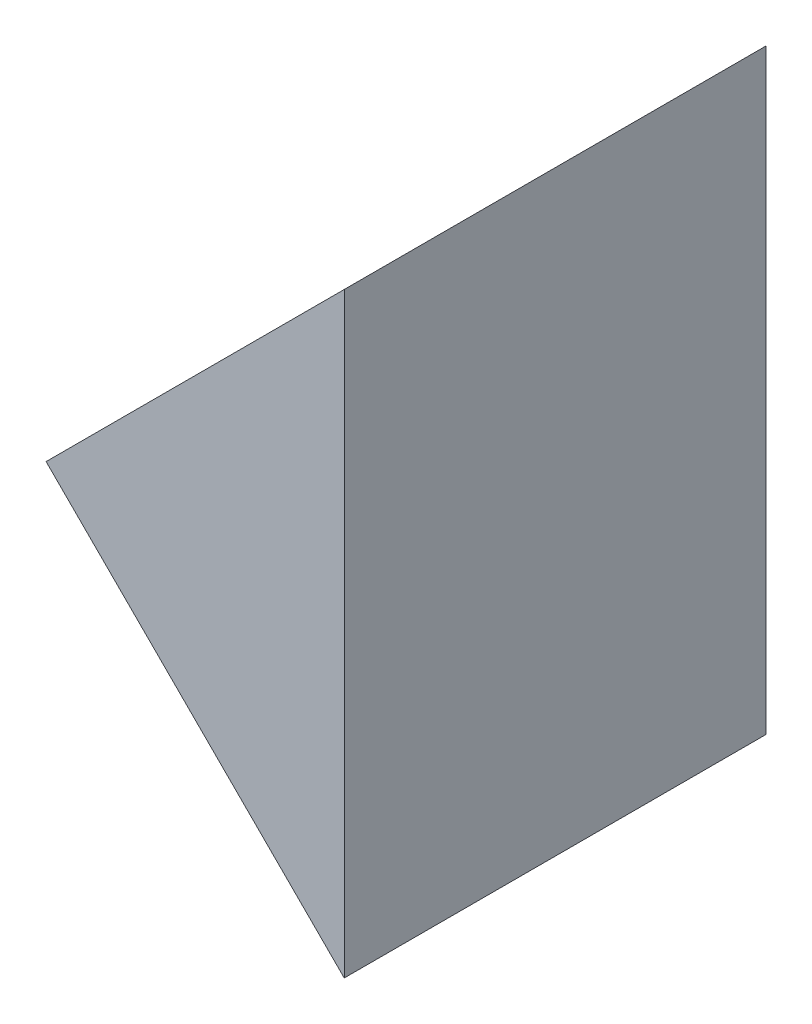
ISO-10303-21;
HEADER;
FILE_DESCRIPTION(('STEP AP214'),'2;1');
FILE_NAME('part.step','',(''),(''),'','','');
FILE_SCHEMA(('AUTOMOTIVE_DESIGN { 1 0 10303 214 1 1 1 1 }'));
ENDSEC;
DATA;
#1=APPLICATION_CONTEXT('core data for automotive mechanical design processes');
#2=APPLICATION_PROTOCOL_DEFINITION('international standard','automotive_design',2000,#1);
#3=PRODUCT_CONTEXT('',#1,'mechanical');
#4=PRODUCT('Part','Part','',(#3));
#5=PRODUCT_RELATED_PRODUCT_CATEGORY('part','',(#4));
#6=PRODUCT_DEFINITION_FORMATION('','',#4);
#7=PRODUCT_DEFINITION_CONTEXT('part definition',#1,'design');
#8=PRODUCT_DEFINITION('design','',#6,#7);
#9=PRODUCT_DEFINITION_SHAPE('','',#8);
#10=(LENGTH_UNIT() NAMED_UNIT(*) SI_UNIT(.MILLI.,.METRE.));
#11=(NAMED_UNIT(*) PLANE_ANGLE_UNIT() SI_UNIT($,.RADIAN.));
#12=(NAMED_UNIT(*) SI_UNIT($,.STERADIAN.) SOLID_ANGLE_UNIT());
#13=UNCERTAINTY_MEASURE_WITH_UNIT(LENGTH_MEASURE(1.E-05),#10,'distance_accuracy_value','');
#14=(GEOMETRIC_REPRESENTATION_CONTEXT(3) GLOBAL_UNCERTAINTY_ASSIGNED_CONTEXT((#13)) GLOBAL_UNIT_ASSIGNED_CONTEXT((#10,
#11,#12)) REPRESENTATION_CONTEXT('',''));
#15=CARTESIAN_POINT('',(0.,0.,0.));
#16=DIRECTION('',(0.,0.,1.));
#17=DIRECTION('',(1.,0.,0.));
#18=AXIS2_PLACEMENT_3D('',#15,#16,#17);
#19=CARTESIAN_POINT('',(110.95333990519,27.5513851056681,10.));
#20=DIRECTION('',(0.707106781186548,0.707106781186547,0.));
#21=DIRECTION('',(-0.707106781186547,0.707106781186548,0.));
#22=AXIS2_PLACEMENT_3D('',#19,#20,#21);
#23=PLANE('',#22);
#24=DIRECTION('',(0.707106781186547,-0.707106781186548,0.));
#25=VECTOR('',#24,1.);
#26=CARTESIAN_POINT('',(110.95333990519,27.5513851056681,0.));
#27=LINE('',#26,#25);
#28=CARTESIAN_POINT('',(110.95333990519,27.5513851056681,0.));
#29=VERTEX_POINT('',#28);
#30=CARTESIAN_POINT('',(118.024407717055,20.4803172938026,0.));
#31=VERTEX_POINT('',#30);
#32=EDGE_CURVE('E84',#29,#31,#27,.T.);
#33=ORIENTED_EDGE('',*,*,#32,.T.);
#34=DIRECTION('',(0.,0.,-1.));
#35=VECTOR('',#34,1.);
#36=CARTESIAN_POINT('',(118.024407717055,20.4803172938026,10.));
#37=LINE('',#36,#35);
#38=CARTESIAN_POINT('',(118.024407717055,20.4803172938026,10.));
#39=VERTEX_POINT('',#38);
#40=EDGE_CURVE('E11',#39,#31,#37,.T.);
#41=ORIENTED_EDGE('',*,*,#40,.F.);
#42=DIRECTION('',(0.707106781186547,-0.707106781186548,0.));
#43=VECTOR('',#42,1.);
#44=CARTESIAN_POINT('',(110.95333990519,27.5513851056681,10.));
#45=LINE('',#44,#43);
#46=CARTESIAN_POINT('',(110.95333990519,27.5513851056681,10.));
#47=VERTEX_POINT('',#46);
#48=EDGE_CURVE('E77',#47,#39,#45,.T.);
#49=ORIENTED_EDGE('',*,*,#48,.F.);
#50=DIRECTION('',(0.,0.,-1.));
#51=VECTOR('',#50,1.);
#52=CARTESIAN_POINT('',(110.95333990519,27.5513851056681,10.));
#53=LINE('',#52,#51);
#54=EDGE_CURVE('E85',#47,#29,#53,.T.);
#55=ORIENTED_EDGE('',*,*,#54,.T.);
#56=EDGE_LOOP('',(#33,#41,#49,#55));
#57=FACE_BOUND('',#56,.T.);
#58=ADVANCED_FACE('F37',(#57),#23,.F.);
#59=CARTESIAN_POINT('',(118.024407717055,20.4803172938026,10.));
#60=DIRECTION('',(-1.,0.,0.));
#61=DIRECTION('',(0.,-1.,0.));
#62=AXIS2_PLACEMENT_3D('',#59,#60,#61);
#63=PLANE('',#62);
#64=DIRECTION('',(0.,1.,0.));
#65=VECTOR('',#64,1.);
#66=CARTESIAN_POINT('',(118.024407717055,20.4803172938026,0.));
#67=LINE('',#66,#65);
#68=CARTESIAN_POINT('',(118.024407717055,34.6224529175336,0.));
#69=VERTEX_POINT('',#68);
#70=EDGE_CURVE('E65',#31,#69,#67,.T.);
#71=ORIENTED_EDGE('',*,*,#70,.T.);
#72=DIRECTION('',(0.,0.,-1.));
#73=VECTOR('',#72,1.);
#74=CARTESIAN_POINT('',(118.024407717055,34.6224529175336,10.));
#75=LINE('',#74,#73);
#76=CARTESIAN_POINT('',(118.024407717055,34.6224529175336,10.));
#77=VERTEX_POINT('',#76);
#78=EDGE_CURVE('E45',#77,#69,#75,.T.);
#79=ORIENTED_EDGE('',*,*,#78,.F.);
#80=DIRECTION('',(0.,1.,0.));
#81=VECTOR('',#80,1.);
#82=CARTESIAN_POINT('',(118.024407717055,20.4803172938026,10.));
#83=LINE('',#82,#81);
#84=EDGE_CURVE('E73',#39,#77,#83,.T.);
#85=ORIENTED_EDGE('',*,*,#84,.F.);
#86=ORIENTED_EDGE('',*,*,#40,.T.);
#87=EDGE_LOOP('',(#71,#79,#85,#86));
#88=FACE_BOUND('',#87,.T.);
#89=ADVANCED_FACE('F74',(#88),#63,.F.);
#90=CARTESIAN_POINT('',(110.95333990519,27.5513851056681,10.));
#91=DIRECTION('',(0.707106781186546,-0.707106781186549,0.));
#92=DIRECTION('',(0.707106781186549,0.707106781186546,0.));
#93=AXIS2_PLACEMENT_3D('',#90,#91,#92);
#94=PLANE('',#93);
#95=DIRECTION('',(-0.707106781186549,-0.707106781186546,0.));
#96=VECTOR('',#95,1.);
#97=CARTESIAN_POINT('',(110.95333990519,27.5513851056681,0.));
#98=LINE('',#97,#96);
#99=EDGE_CURVE('E70',#69,#29,#98,.T.);
#100=ORIENTED_EDGE('',*,*,#99,.T.);
#101=ORIENTED_EDGE('',*,*,#54,.F.);
#102=DIRECTION('',(-0.707106781186549,-0.707106781186546,0.));
#103=VECTOR('',#102,1.);
#104=CARTESIAN_POINT('',(110.95333990519,27.5513851056681,10.));
#105=LINE('',#104,#103);
#106=EDGE_CURVE('E53',#77,#47,#105,.T.);
#107=ORIENTED_EDGE('',*,*,#106,.F.);
#108=ORIENTED_EDGE('',*,*,#78,.T.);
#109=EDGE_LOOP('',(#100,#101,#107,#108));
#110=FACE_BOUND('',#109,.T.);
#111=ADVANCED_FACE('F92',(#110),#94,.F.);
#112=CARTESIAN_POINT('',(0.,0.,10.));
#113=DIRECTION('',(0.,0.,1.));
#114=DIRECTION('',(1.,0.,0.));
#115=AXIS2_PLACEMENT_3D('',#112,#113,#114);
#116=PLANE('',#115);
#117=ORIENTED_EDGE('',*,*,#48,.T.);
#118=ORIENTED_EDGE('',*,*,#84,.T.);
#119=ORIENTED_EDGE('',*,*,#106,.T.);
#120=EDGE_LOOP('',(#117,#118,#119));
#121=FACE_BOUND('',#120,.T.);
#122=ADVANCED_FACE('F80',(#121),#116,.T.);
#123=CARTESIAN_POINT('',(0.,0.,0.));
#124=DIRECTION('',(0.,0.,1.));
#125=DIRECTION('',(1.,0.,0.));
#126=AXIS2_PLACEMENT_3D('',#123,#124,#125);
#127=PLANE('',#126);
#128=ORIENTED_EDGE('',*,*,#32,.F.);
#129=ORIENTED_EDGE('',*,*,#99,.F.);
#130=ORIENTED_EDGE('',*,*,#70,.F.);
#131=EDGE_LOOP('',(#128,#129,#130));
#132=FACE_BOUND('',#131,.T.);
#133=ADVANCED_FACE('F93',(#132),#127,.F.);
#134=CLOSED_SHELL('',(#58,#89,#111,#122,#133));
#135=MANIFOLD_SOLID_BREP('B2',#134);
#136=ADVANCED_BREP_SHAPE_REPRESENTATION('',(#18,#135),#14);
#137=SHAPE_DEFINITION_REPRESENTATION(#9,#136);
ENDSEC;
END-ISO-10303-21;
